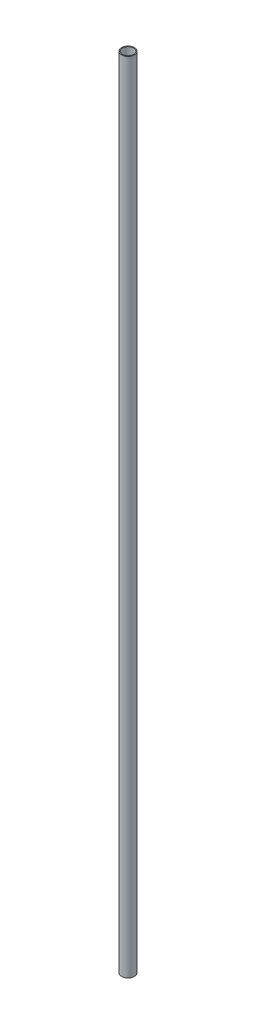
ISO-10303-21;
HEADER;
FILE_DESCRIPTION(('STEP AP214'),'2;1');
FILE_NAME('part.step','',(''),(''),'','','');
FILE_SCHEMA(('AUTOMOTIVE_DESIGN { 1 0 10303 214 1 1 1 1 }'));
ENDSEC;
DATA;
#1=APPLICATION_CONTEXT('core data for automotive mechanical design processes');
#2=APPLICATION_PROTOCOL_DEFINITION('international standard','automotive_design',2000,#1);
#3=PRODUCT_CONTEXT('',#1,'mechanical');
#4=PRODUCT('Part','Part','',(#3));
#5=PRODUCT_RELATED_PRODUCT_CATEGORY('part','',(#4));
#6=PRODUCT_DEFINITION_FORMATION('','',#4);
#7=PRODUCT_DEFINITION_CONTEXT('part definition',#1,'design');
#8=PRODUCT_DEFINITION('design','',#6,#7);
#9=PRODUCT_DEFINITION_SHAPE('','',#8);
#10=(LENGTH_UNIT() NAMED_UNIT(*) SI_UNIT(.MILLI.,.METRE.));
#11=(NAMED_UNIT(*) PLANE_ANGLE_UNIT() SI_UNIT($,.RADIAN.));
#12=(NAMED_UNIT(*) SI_UNIT($,.STERADIAN.) SOLID_ANGLE_UNIT());
#13=UNCERTAINTY_MEASURE_WITH_UNIT(LENGTH_MEASURE(1.E-05),#10,'distance_accuracy_value','');
#14=(GEOMETRIC_REPRESENTATION_CONTEXT(3) GLOBAL_UNCERTAINTY_ASSIGNED_CONTEXT((#13)) GLOBAL_UNIT_ASSIGNED_CONTEXT((#10,
#11,#12)) REPRESENTATION_CONTEXT('',''));
#15=CARTESIAN_POINT('',(0.,0.,0.));
#16=DIRECTION('',(0.,0.,1.));
#17=DIRECTION('',(1.,0.,0.));
#18=AXIS2_PLACEMENT_3D('',#15,#16,#17);
#19=CARTESIAN_POINT('',(0.,500.,0.));
#20=DIRECTION('',(0.,1.,0.));
#21=DIRECTION('',(0.,0.,1.));
#22=AXIS2_PLACEMENT_3D('',#19,#20,#21);
#23=PLANE('',#22);
#24=CARTESIAN_POINT('',(0.,500.,0.));
#25=DIRECTION('',(0.,1.,0.));
#26=DIRECTION('',(0.,0.,1.));
#27=AXIS2_PLACEMENT_3D('',#24,#25,#26);
#28=CIRCLE('',#27,4.);
#29=CARTESIAN_POINT('',(0.,500.,4.));
#30=VERTEX_POINT('',#29);
#31=EDGE_CURVE('E10',#30,#30,#28,.T.);
#32=ORIENTED_EDGE('',*,*,#31,.T.);
#33=EDGE_LOOP('',(#32));
#34=FACE_BOUND('',#33,.T.);
#35=CARTESIAN_POINT('',(0.,500.,0.));
#36=DIRECTION('',(0.,1.,0.));
#37=DIRECTION('',(0.,0.,1.));
#38=AXIS2_PLACEMENT_3D('',#35,#36,#37);
#39=CIRCLE('',#38,3.5);
#40=CARTESIAN_POINT('',(0.,500.,3.5));
#41=VERTEX_POINT('',#40);
#42=EDGE_CURVE('E48',#41,#41,#39,.T.);
#43=ORIENTED_EDGE('',*,*,#42,.F.);
#44=EDGE_LOOP('',(#43));
#45=FACE_BOUND('',#44,.T.);
#46=ADVANCED_FACE('F37',(#34,#45),#23,.T.);
#47=CARTESIAN_POINT('',(0.,0.,0.));
#48=DIRECTION('',(0.,1.,0.));
#49=DIRECTION('',(0.,0.,1.));
#50=AXIS2_PLACEMENT_3D('',#47,#48,#49);
#51=PLANE('',#50);
#52=CARTESIAN_POINT('',(0.,0.,0.));
#53=DIRECTION('',(0.,1.,0.));
#54=DIRECTION('',(0.,0.,1.));
#55=AXIS2_PLACEMENT_3D('',#52,#53,#54);
#56=CIRCLE('',#55,4.);
#57=CARTESIAN_POINT('',(0.,0.,4.));
#58=VERTEX_POINT('',#57);
#59=EDGE_CURVE('E41',#58,#58,#56,.T.);
#60=ORIENTED_EDGE('',*,*,#59,.F.);
#61=EDGE_LOOP('',(#60));
#62=FACE_BOUND('',#61,.T.);
#63=CARTESIAN_POINT('',(0.,0.,0.));
#64=DIRECTION('',(0.,1.,0.));
#65=DIRECTION('',(0.,0.,1.));
#66=AXIS2_PLACEMENT_3D('',#63,#64,#65);
#67=CIRCLE('',#66,3.5);
#68=CARTESIAN_POINT('',(0.,0.,3.5));
#69=VERTEX_POINT('',#68);
#70=EDGE_CURVE('E50',#69,#69,#67,.T.);
#71=ORIENTED_EDGE('',*,*,#70,.T.);
#72=EDGE_LOOP('',(#71));
#73=FACE_BOUND('',#72,.T.);
#74=ADVANCED_FACE('F60',(#62,#73),#51,.F.);
#75=CARTESIAN_POINT('',(0.,500.,0.));
#76=DIRECTION('',(0.,-1.,0.));
#77=DIRECTION('',(0.,0.,-1.));
#78=AXIS2_PLACEMENT_3D('',#75,#76,#77);
#79=CYLINDRICAL_SURFACE('',#78,4.);
#80=ORIENTED_EDGE('',*,*,#31,.F.);
#81=EDGE_LOOP('',(#80));
#82=FACE_BOUND('',#81,.T.);
#83=ORIENTED_EDGE('',*,*,#59,.T.);
#84=EDGE_LOOP('',(#83));
#85=FACE_BOUND('',#84,.T.);
#86=ADVANCED_FACE('F39',(#82,#85),#79,.T.);
#87=CARTESIAN_POINT('',(0.,500.,0.));
#88=DIRECTION('',(0.,-1.,0.));
#89=DIRECTION('',(0.,0.,-1.));
#90=AXIS2_PLACEMENT_3D('',#87,#88,#89);
#91=CYLINDRICAL_SURFACE('',#90,3.5);
#92=ORIENTED_EDGE('',*,*,#42,.T.);
#93=EDGE_LOOP('',(#92));
#94=FACE_BOUND('',#93,.T.);
#95=ORIENTED_EDGE('',*,*,#70,.F.);
#96=EDGE_LOOP('',(#95));
#97=FACE_BOUND('',#96,.T.);
#98=ADVANCED_FACE('F56',(#94,#97),#91,.F.);
#99=CLOSED_SHELL('',(#46,#74,#86,#98));
#100=MANIFOLD_SOLID_BREP('B2',#99);
#101=ADVANCED_BREP_SHAPE_REPRESENTATION('',(#18,#100),#14);
#102=SHAPE_DEFINITION_REPRESENTATION(#9,#101);
ENDSEC;
END-ISO-10303-21;
